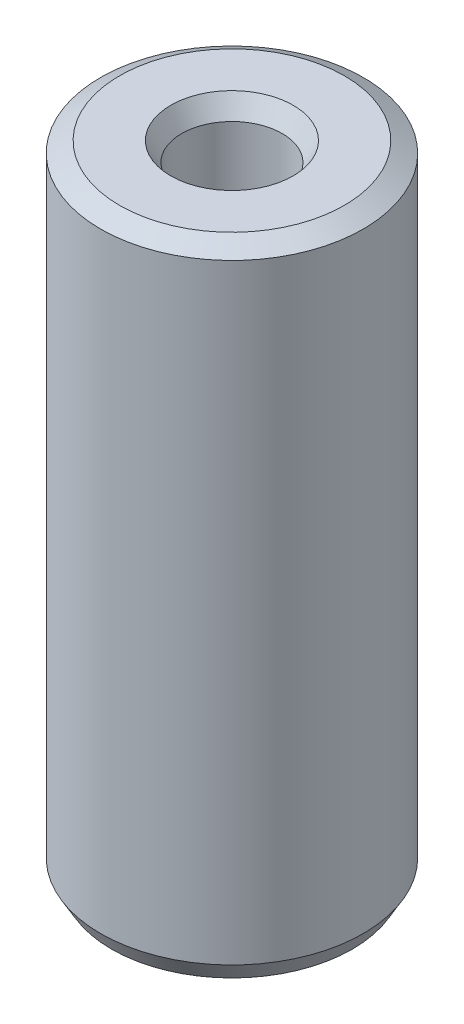
ISO-10303-21;
HEADER;
FILE_DESCRIPTION(('STEP AP214'),'2;1');
FILE_NAME('part.step','',(''),(''),'','','');
FILE_SCHEMA(('AUTOMOTIVE_DESIGN { 1 0 10303 214 1 1 1 1 }'));
ENDSEC;
DATA;
#1=APPLICATION_CONTEXT('core data for automotive mechanical design processes');
#2=APPLICATION_PROTOCOL_DEFINITION('international standard','automotive_design',2000,#1);
#3=PRODUCT_CONTEXT('',#1,'mechanical');
#4=PRODUCT('Part','Part','',(#3));
#5=PRODUCT_RELATED_PRODUCT_CATEGORY('part','',(#4));
#6=PRODUCT_DEFINITION_FORMATION('','',#4);
#7=PRODUCT_DEFINITION_CONTEXT('part definition',#1,'design');
#8=PRODUCT_DEFINITION('design','',#6,#7);
#9=PRODUCT_DEFINITION_SHAPE('','',#8);
#10=(LENGTH_UNIT() NAMED_UNIT(*) SI_UNIT(.MILLI.,.METRE.));
#11=(NAMED_UNIT(*) PLANE_ANGLE_UNIT() SI_UNIT($,.RADIAN.));
#12=(NAMED_UNIT(*) SI_UNIT($,.STERADIAN.) SOLID_ANGLE_UNIT());
#13=UNCERTAINTY_MEASURE_WITH_UNIT(LENGTH_MEASURE(1.E-05),#10,'distance_accuracy_value','');
#14=(GEOMETRIC_REPRESENTATION_CONTEXT(3) GLOBAL_UNCERTAINTY_ASSIGNED_CONTEXT((#13)) GLOBAL_UNIT_ASSIGNED_CONTEXT((#10,
#11,#12)) REPRESENTATION_CONTEXT('',''));
#15=CARTESIAN_POINT('',(0.,0.,0.));
#16=DIRECTION('',(0.,0.,1.));
#17=DIRECTION('',(1.,0.,0.));
#18=AXIS2_PLACEMENT_3D('',#15,#16,#17);
#19=CARTESIAN_POINT('',(0.,158.386331226338,0.));
#20=DIRECTION('',(0.,-1.,0.));
#21=DIRECTION('',(0.,0.,-1.));
#22=AXIS2_PLACEMENT_3D('',#19,#20,#21);
#23=CYLINDRICAL_SURFACE('',#22,32.5);
#24=CARTESIAN_POINT('',(0.,4.70205699553733,0.));
#25=DIRECTION('',(0.,1.,0.));
#26=DIRECTION('',(0.,0.,1.));
#27=AXIS2_PLACEMENT_3D('',#24,#25,#26);
#28=CIRCLE('',#27,32.5);
#29=CARTESIAN_POINT('',(0.,4.70205699553733,32.5));
#30=VERTEX_POINT('',#29);
#31=EDGE_CURVE('E10',#30,#30,#28,.T.);
#32=ORIENTED_EDGE('',*,*,#31,.T.);
#33=EDGE_LOOP('',(#32));
#34=FACE_BOUND('',#33,.T.);
#35=CARTESIAN_POINT('',(0.,155.67159735422,0.));
#36=DIRECTION('',(0.,1.,0.));
#37=DIRECTION('',(0.,0.,1.));
#38=AXIS2_PLACEMENT_3D('',#35,#36,#37);
#39=CIRCLE('',#38,32.5);
#40=CARTESIAN_POINT('',(0.,155.67159735422,32.5));
#41=VERTEX_POINT('',#40);
#42=EDGE_CURVE('E50',#41,#41,#39,.F.);
#43=ORIENTED_EDGE('',*,*,#42,.T.);
#44=EDGE_LOOP('',(#43));
#45=FACE_BOUND('',#44,.T.);
#46=ADVANCED_FACE('F39',(#34,#45),#23,.T.);
#47=CARTESIAN_POINT('',(0.,158.386331226338,0.));
#48=DIRECTION('',(0.,1.,0.));
#49=DIRECTION('',(0.,0.,1.));
#50=AXIS2_PLACEMENT_3D('',#47,#48,#49);
#51=PLANE('',#50);
#52=CARTESIAN_POINT('',(0.,158.386331226338,0.));
#53=DIRECTION('',(0.,1.,0.));
#54=DIRECTION('',(0.,0.,1.));
#55=AXIS2_PLACEMENT_3D('',#52,#53,#54);
#56=CIRCLE('',#55,15.1487478878507);
#57=CARTESIAN_POINT('',(0.,158.386331226338,15.1487478878507));
#58=VERTEX_POINT('',#57);
#59=EDGE_CURVE('E58',#58,#58,#56,.F.);
#60=ORIENTED_EDGE('',*,*,#59,.T.);
#61=EDGE_LOOP('',(#60));
#62=FACE_BOUND('',#61,.T.);
#63=CARTESIAN_POINT('',(0.,158.386331226338,0.));
#64=DIRECTION('',(0.,1.,0.));
#65=DIRECTION('',(0.,0.,1.));
#66=AXIS2_PLACEMENT_3D('',#63,#64,#65);
#67=CIRCLE('',#66,27.7979430044627);
#68=CARTESIAN_POINT('',(0.,158.386331226338,27.7979430044627));
#69=VERTEX_POINT('',#68);
#70=EDGE_CURVE('E61',#69,#69,#67,.T.);
#71=ORIENTED_EDGE('',*,*,#70,.T.);
#72=EDGE_LOOP('',(#71));
#73=FACE_BOUND('',#72,.T.);
#74=ADVANCED_FACE('F88',(#62,#73),#51,.T.);
#75=CARTESIAN_POINT('',(0.,0.,0.));
#76=DIRECTION('',(0.,1.,0.));
#77=DIRECTION('',(0.,0.,1.));
#78=AXIS2_PLACEMENT_3D('',#75,#76,#77);
#79=PLANE('',#78);
#80=CARTESIAN_POINT('',(0.,0.,0.));
#81=DIRECTION('',(0.,1.,0.));
#82=DIRECTION('',(0.,0.,1.));
#83=AXIS2_PLACEMENT_3D('',#80,#81,#82);
#84=CIRCLE('',#83,17.1360710112696);
#85=CARTESIAN_POINT('',(0.,0.,17.1360710112696));
#86=VERTEX_POINT('',#85);
#87=EDGE_CURVE('E51',#86,#86,#84,.T.);
#88=ORIENTED_EDGE('',*,*,#87,.T.);
#89=EDGE_LOOP('',(#88));
#90=FACE_BOUND('',#89,.T.);
#91=CARTESIAN_POINT('',(0.,0.,0.));
#92=DIRECTION('',(0.,1.,0.));
#93=DIRECTION('',(0.,0.,1.));
#94=AXIS2_PLACEMENT_3D('',#91,#92,#93);
#95=CIRCLE('',#94,29.7852661278815);
#96=CARTESIAN_POINT('',(0.,0.,29.7852661278815));
#97=VERTEX_POINT('',#96);
#98=EDGE_CURVE('E54',#97,#97,#95,.F.);
#99=ORIENTED_EDGE('',*,*,#98,.T.);
#100=EDGE_LOOP('',(#99));
#101=FACE_BOUND('',#100,.T.);
#102=ADVANCED_FACE('F83',(#90,#101),#79,.F.);
#103=CARTESIAN_POINT('',(0.,158.386331226338,0.));
#104=DIRECTION('',(0.,-1.,0.));
#105=DIRECTION('',(0.,0.,-1.));
#106=AXIS2_PLACEMENT_3D('',#103,#104,#105);
#107=CYLINDRICAL_SURFACE('',#106,12.4340140157323);
#108=CARTESIAN_POINT('',(0.,153.684274230801,0.));
#109=DIRECTION('',(0.,1.,0.));
#110=DIRECTION('',(0.,0.,1.));
#111=AXIS2_PLACEMENT_3D('',#108,#109,#110);
#112=CIRCLE('',#111,12.4340140157323);
#113=CARTESIAN_POINT('',(0.,153.684274230801,12.4340140157323));
#114=VERTEX_POINT('',#113);
#115=EDGE_CURVE('E67',#114,#114,#112,.T.);
#116=ORIENTED_EDGE('',*,*,#115,.T.);
#117=EDGE_LOOP('',(#116));
#118=FACE_BOUND('',#117,.T.);
#119=CARTESIAN_POINT('',(0.,2.71473387211843,0.));
#120=DIRECTION('',(0.,1.,0.));
#121=DIRECTION('',(0.,0.,1.));
#122=AXIS2_PLACEMENT_3D('',#119,#120,#121);
#123=CIRCLE('',#122,12.4340140157323);
#124=CARTESIAN_POINT('',(0.,2.71473387211843,12.4340140157323));
#125=VERTEX_POINT('',#124);
#126=EDGE_CURVE('E69',#125,#125,#123,.F.);
#127=ORIENTED_EDGE('',*,*,#126,.T.);
#128=EDGE_LOOP('',(#127));
#129=FACE_BOUND('',#128,.T.);
#130=ADVANCED_FACE('F71',(#118,#129),#107,.F.);
#131=CARTESIAN_POINT('',(0.,153.684274230801,0.));
#132=DIRECTION('',(0.,1.,0.));
#133=DIRECTION('',(0.,0.,1.));
#134=AXIS2_PLACEMENT_3D('',#131,#132,#133);
#135=CONICAL_SURFACE('',#134,12.4340140157323,0.523598775598301);
#136=ORIENTED_EDGE('',*,*,#59,.F.);
#137=EDGE_LOOP('',(#136));
#138=FACE_BOUND('',#137,.T.);
#139=ORIENTED_EDGE('',*,*,#115,.F.);
#140=EDGE_LOOP('',(#139));
#141=FACE_BOUND('',#140,.T.);
#142=ADVANCED_FACE('F77',(#138,#141),#135,.F.);
#143=CARTESIAN_POINT('',(0.,0.,0.));
#144=DIRECTION('',(0.,-1.,0.));
#145=DIRECTION('',(0.,0.,-1.));
#146=AXIS2_PLACEMENT_3D('',#143,#144,#145);
#147=CONICAL_SURFACE('',#146,17.1360710112696,1.04719755119659);
#148=ORIENTED_EDGE('',*,*,#126,.F.);
#149=EDGE_LOOP('',(#148));
#150=FACE_BOUND('',#149,.T.);
#151=ORIENTED_EDGE('',*,*,#87,.F.);
#152=EDGE_LOOP('',(#151));
#153=FACE_BOUND('',#152,.T.);
#154=ADVANCED_FACE('F73',(#150,#153),#147,.F.);
#155=CARTESIAN_POINT('',(0.,4.70205699553733,0.));
#156=DIRECTION('',(0.,1.,0.));
#157=DIRECTION('',(0.,0.,1.));
#158=AXIS2_PLACEMENT_3D('',#155,#156,#157);
#159=CONICAL_SURFACE('',#158,32.5,0.523598775598302);
#160=CARTESIAN_POINT('',(0.,0.,29.7852661278815));
#161=CARTESIAN_POINT('',(0.,0.0489797603701805,29.8135446057161));
#162=CARTESIAN_POINT('',(0.,0.0979595207403607,29.8418230835507));
#163=CARTESIAN_POINT('',(0.,0.195919041480721,29.8983800392198));
#164=CARTESIAN_POINT('',(0.,0.244898801850901,29.9266585170544));
#165=CARTESIAN_POINT('',(0.,0.342858322591263,29.9832154727235));
#166=CARTESIAN_POINT('',(0.,0.391838082961444,30.0114939505581));
#167=CARTESIAN_POINT('',(0.,0.489797603701805,30.0680509062272));
#168=CARTESIAN_POINT('',(0.,0.538777364071985,30.0963293840618));
#169=CARTESIAN_POINT('',(0.,0.636736884812346,30.1528863397309));
#170=CARTESIAN_POINT('',(0.,0.685716645182527,30.1811648175655));
#171=CARTESIAN_POINT('',(0.,0.783676165922888,30.2377217732346));
#172=CARTESIAN_POINT('',(0.,0.832655926293068,30.2660002510692));
#173=CARTESIAN_POINT('',(0.,0.930615447033429,30.3225572067383));
#174=CARTESIAN_POINT('',(0.,0.97959520740361,30.3508356845729));
#175=CARTESIAN_POINT('',(0.,1.07755472814397,30.407392640242));
#176=CARTESIAN_POINT('',(0.,1.12653448851415,30.4356711180766));
#177=CARTESIAN_POINT('',(0.,1.22449400925451,30.4922280737457));
#178=CARTESIAN_POINT('',(0.,1.27347376962469,30.5205065515803));
#179=CARTESIAN_POINT('',(0.,1.37143329036505,30.5770635072494));
#180=CARTESIAN_POINT('',(0.,1.42041305073523,30.605341985084));
#181=CARTESIAN_POINT('',(0.,1.51837257147559,30.6618989407531));
#182=CARTESIAN_POINT('',(0.,1.56735233184578,30.6901774185877));
#183=CARTESIAN_POINT('',(0.,1.66531185258614,30.7467343742568));
#184=CARTESIAN_POINT('',(0.,1.71429161295632,30.7750128520914));
#185=CARTESIAN_POINT('',(0.,1.81225113369668,30.8315698077605));
#186=CARTESIAN_POINT('',(0.,1.86123089406686,30.8598482855951));
#187=CARTESIAN_POINT('',(0.,1.95919041480722,30.9164052412642));
#188=CARTESIAN_POINT('',(0.,2.0081701751774,30.9446837190988));
#189=CARTESIAN_POINT('',(0.,2.10612969591776,31.0012406747679));
#190=CARTESIAN_POINT('',(0.,2.15510945628794,31.0295191526025));
#191=CARTESIAN_POINT('',(0.,2.2530689770283,31.0860761082716));
#192=CARTESIAN_POINT('',(0.,2.30204873739848,31.1143545861062));
#193=CARTESIAN_POINT('',(0.,2.40000825813884,31.1709115417753));
#194=CARTESIAN_POINT('',(0.,2.44898801850902,31.1991900196099));
#195=CARTESIAN_POINT('',(0.,2.54694753924939,31.255746975279));
#196=CARTESIAN_POINT('',(0.,2.59592729961957,31.2840254531136));
#197=CARTESIAN_POINT('',(0.,2.69388682035993,31.3405824087827));
#198=CARTESIAN_POINT('',(0.,2.74286658073011,31.3688608866173));
#199=CARTESIAN_POINT('',(0.,2.84082610147047,31.4254178422864));
#200=CARTESIAN_POINT('',(0.,2.88980586184065,31.453696320121));
#201=CARTESIAN_POINT('',(0.,2.98776538258101,31.5102532757901));
#202=CARTESIAN_POINT('',(0.,3.03674514295119,31.5385317536247));
#203=CARTESIAN_POINT('',(0.,3.13470466369155,31.5950887092938));
#204=CARTESIAN_POINT('',(0.,3.18368442406173,31.6233671871284));
#205=CARTESIAN_POINT('',(0.,3.2816439448021,31.6799241427975));
#206=CARTESIAN_POINT('',(0.,3.33062370517228,31.7082026206321));
#207=CARTESIAN_POINT('',(0.,3.42858322591264,31.7647595763013));
#208=CARTESIAN_POINT('',(0.,3.47756298628282,31.7930380541358));
#209=CARTESIAN_POINT('',(0.,3.57552250702318,31.849595009805));
#210=CARTESIAN_POINT('',(0.,3.62450226739336,31.8778734876395));
#211=CARTESIAN_POINT('',(0.,3.72246178813372,31.9344304433087));
#212=CARTESIAN_POINT('',(0.,3.7714415485039,31.9627089211432));
#213=CARTESIAN_POINT('',(0.,3.86940106924426,32.0192658768124));
#214=CARTESIAN_POINT('',(0.,3.91838082961444,32.0475443546469));
#215=CARTESIAN_POINT('',(0.,4.0163403503548,32.1041013103161));
#216=CARTESIAN_POINT('',(0.,4.06532011072498,32.1323797881506));
#217=CARTESIAN_POINT('',(0.,4.16327963146534,32.1889367438198));
#218=CARTESIAN_POINT('',(0.,4.21225939183552,32.2172152216543));
#219=CARTESIAN_POINT('',(0.,4.31021891257588,32.2737721773235));
#220=CARTESIAN_POINT('',(0.,4.35919867294607,32.302050655158));
#221=CARTESIAN_POINT('',(0.,4.45715819368643,32.3586076108272));
#222=CARTESIAN_POINT('',(0.,4.50613795405661,32.3868860886617));
#223=CARTESIAN_POINT('',(0.,4.60409747479697,32.4434430443309));
#224=CARTESIAN_POINT('',(0.,4.65307723516715,32.4717215221654));
#225=CARTESIAN_POINT('',(0.,4.70205699553733,32.5));
#226=B_SPLINE_CURVE_WITH_KNOTS('',3,(#160,#161,#162,#163,#164,#165,#166,#167,#168,#169,#170,
#171,#172,#173,#174,#175,#176,#177,#178,#179,#180,#181,#182,#183,#184,#185,#186,#187,#188,#189,
#190,#191,#192,#193,#194,#195,#196,#197,#198,#199,#200,#201,#202,#203,#204,#205,#206,#207,#208,
#209,#210,#211,#212,#213,#214,#215,#216,#217,#218,#219,#220,#221,#222,#223,#224,#225),
.UNSPECIFIED.,.F.,.F.,(4,2,2,2,2,2,2,2,2,2,2,2,2,2,2,2,2,2,2,2,2,2,2,2,2,2,2,2,2,2,2,2,4),(0.,
0.169670867007402,0.339341734014806,0.509012601022207,0.678683468029611,0.848354335037013,
1.01802520204442,1.18769606905182,1.35736693605922,1.52703780306662,1.69670867007403,
1.86637953708143,2.03605040408883,2.20572127109624,2.37539213810364,2.54506300511104,
2.71473387211844,2.88440473912585,3.05407560613325,3.22374647314065,3.39341734014806,
3.56308820715546,3.73275907416286,3.90242994117026,4.07210080817767,4.24177167518507,
4.41144254219247,4.58111340919988,4.75078427620728,4.92045514321468,5.09012601022208,
5.25979687722949,5.42946774423689),.UNSPECIFIED.);
#227=EDGE_CURVE('BSEAM76',#97,#30,#226,.T.);
#228=ORIENTED_EDGE('',*,*,#98,.F.);
#229=ORIENTED_EDGE('',*,*,#31,.F.);
#230=ORIENTED_EDGE('',*,*,#227,.T.);
#231=ORIENTED_EDGE('',*,*,#227,.F.);
#232=EDGE_LOOP('',(#228,#230,#229,#231));
#233=FACE_BOUND('',#232,.T.);
#234=ADVANCED_FACE('F76',(#233),#159,.T.);
#235=CARTESIAN_POINT('',(0.,158.386331226338,0.));
#236=DIRECTION('',(0.,-1.,0.));
#237=DIRECTION('',(0.,0.,-1.));
#238=AXIS2_PLACEMENT_3D('',#235,#236,#237);
#239=CONICAL_SURFACE('',#238,27.7979430044627,1.0471975511966);
#240=ORIENTED_EDGE('',*,*,#42,.F.);
#241=EDGE_LOOP('',(#240));
#242=FACE_BOUND('',#241,.T.);
#243=ORIENTED_EDGE('',*,*,#70,.F.);
#244=EDGE_LOOP('',(#243));
#245=FACE_BOUND('',#244,.T.);
#246=ADVANCED_FACE('F45',(#242,#245),#239,.T.);
#247=CLOSED_SHELL('',(#46,#74,#102,#130,#142,#154,#234,#246));
#248=MANIFOLD_SOLID_BREP('B2',#247);
#249=ADVANCED_BREP_SHAPE_REPRESENTATION('',(#18,#248),#14);
#250=SHAPE_DEFINITION_REPRESENTATION(#9,#249);
ENDSEC;
END-ISO-10303-21;
